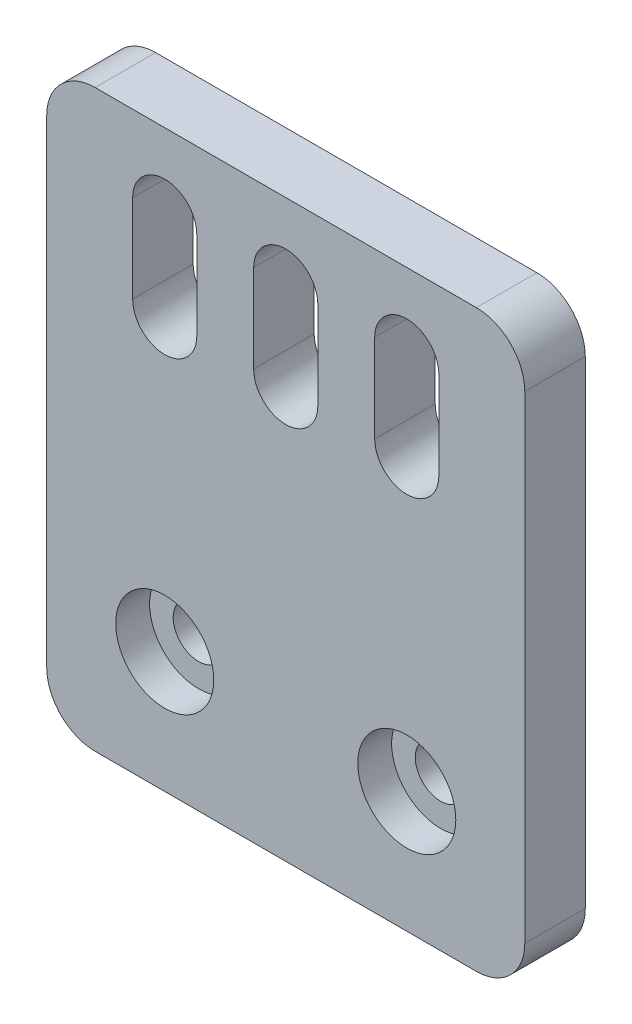
ISO-10303-21;
HEADER;
FILE_DESCRIPTION(('STEP AP214'),'2;1');
FILE_NAME('part.step','',(''),(''),'','','');
FILE_SCHEMA(('AUTOMOTIVE_DESIGN { 1 0 10303 214 1 1 1 1 }'));
ENDSEC;
DATA;
#1=APPLICATION_CONTEXT('core data for automotive mechanical design processes');
#2=APPLICATION_PROTOCOL_DEFINITION('international standard','automotive_design',2000,#1);
#3=PRODUCT_CONTEXT('',#1,'mechanical');
#4=PRODUCT('Part','Part','',(#3));
#5=PRODUCT_RELATED_PRODUCT_CATEGORY('part','',(#4));
#6=PRODUCT_DEFINITION_FORMATION('','',#4);
#7=PRODUCT_DEFINITION_CONTEXT('part definition',#1,'design');
#8=PRODUCT_DEFINITION('design','',#6,#7);
#9=PRODUCT_DEFINITION_SHAPE('','',#8);
#10=(LENGTH_UNIT() NAMED_UNIT(*) SI_UNIT(.MILLI.,.METRE.));
#11=(NAMED_UNIT(*) PLANE_ANGLE_UNIT() SI_UNIT($,.RADIAN.));
#12=(NAMED_UNIT(*) SI_UNIT($,.STERADIAN.) SOLID_ANGLE_UNIT());
#13=UNCERTAINTY_MEASURE_WITH_UNIT(LENGTH_MEASURE(1.E-05),#10,'distance_accuracy_value','');
#14=(GEOMETRIC_REPRESENTATION_CONTEXT(3) GLOBAL_UNCERTAINTY_ASSIGNED_CONTEXT((#13)) GLOBAL_UNIT_ASSIGNED_CONTEXT((#10,
#11,#12)) REPRESENTATION_CONTEXT('',''));
#15=CARTESIAN_POINT('',(0.,0.,0.));
#16=DIRECTION('',(0.,0.,1.));
#17=DIRECTION('',(1.,0.,0.));
#18=AXIS2_PLACEMENT_3D('',#15,#16,#17);
#19=CARTESIAN_POINT('',(9.75000000000001,10.,5.));
#20=DIRECTION('',(0.,0.,-1.));
#21=DIRECTION('',(-1.,0.,0.));
#22=AXIS2_PLACEMENT_3D('',#19,#20,#21);
#23=CYLINDRICAL_SURFACE('',#22,2.09999999999999);
#24=CARTESIAN_POINT('',(9.75000000000001,10.,0.));
#25=DIRECTION('',(0.,0.,1.));
#26=DIRECTION('',(1.,0.,0.));
#27=AXIS2_PLACEMENT_3D('',#24,#25,#26);
#28=CIRCLE('',#27,2.09999999999999);
#29=CARTESIAN_POINT('',(11.85,10.,0.));
#30=VERTEX_POINT('',#29);
#31=EDGE_CURVE('E281',#30,#30,#28,.T.);
#32=ORIENTED_EDGE('',*,*,#31,.F.);
#33=EDGE_LOOP('',(#32));
#34=FACE_BOUND('',#33,.T.);
#35=CARTESIAN_POINT('',(9.75000000000001,10.,2.2));
#36=DIRECTION('',(0.,0.,1.));
#37=DIRECTION('',(1.,0.,0.));
#38=AXIS2_PLACEMENT_3D('',#35,#36,#37);
#39=CIRCLE('',#38,2.09999999999999);
#40=CARTESIAN_POINT('',(11.85,10.,2.2));
#41=VERTEX_POINT('',#40);
#42=EDGE_CURVE('E36',#41,#41,#39,.T.);
#43=ORIENTED_EDGE('',*,*,#42,.T.);
#44=EDGE_LOOP('',(#43));
#45=FACE_BOUND('',#44,.T.);
#46=ADVANCED_FACE('F32',(#34,#45),#23,.F.);
#47=CARTESIAN_POINT('',(29.75,10.,5.));
#48=DIRECTION('',(0.,0.,-1.));
#49=DIRECTION('',(-1.,0.,0.));
#50=AXIS2_PLACEMENT_3D('',#47,#48,#49);
#51=CYLINDRICAL_SURFACE('',#50,2.09999999999999);
#52=CARTESIAN_POINT('',(29.75,10.,0.));
#53=DIRECTION('',(0.,0.,1.));
#54=DIRECTION('',(1.,0.,0.));
#55=AXIS2_PLACEMENT_3D('',#52,#53,#54);
#56=CIRCLE('',#55,2.09999999999999);
#57=CARTESIAN_POINT('',(31.85,10.,0.));
#58=VERTEX_POINT('',#57);
#59=EDGE_CURVE('E278',#58,#58,#56,.T.);
#60=ORIENTED_EDGE('',*,*,#59,.F.);
#61=EDGE_LOOP('',(#60));
#62=FACE_BOUND('',#61,.T.);
#63=CARTESIAN_POINT('',(29.75,10.,2.2));
#64=DIRECTION('',(0.,0.,1.));
#65=DIRECTION('',(1.,0.,0.));
#66=AXIS2_PLACEMENT_3D('',#63,#64,#65);
#67=CIRCLE('',#66,2.09999999999999);
#68=CARTESIAN_POINT('',(31.85,10.,2.2));
#69=VERTEX_POINT('',#68);
#70=EDGE_CURVE('E206',#69,#69,#67,.T.);
#71=ORIENTED_EDGE('',*,*,#70,.T.);
#72=EDGE_LOOP('',(#71));
#73=FACE_BOUND('',#72,.T.);
#74=ADVANCED_FACE('F368',(#62,#73),#51,.F.);
#75=CARTESIAN_POINT('',(0.,0.,5.));
#76=DIRECTION('',(0.,0.,1.));
#77=DIRECTION('',(1.,0.,0.));
#78=AXIS2_PLACEMENT_3D('',#75,#76,#77);
#79=PLANE('',#78);
#80=CARTESIAN_POINT('',(9.75000000000001,10.,5.));
#81=DIRECTION('',(0.,0.,1.));
#82=DIRECTION('',(1.,0.,0.));
#83=AXIS2_PLACEMENT_3D('',#80,#81,#82);
#84=CIRCLE('',#83,4.04999999999999);
#85=CARTESIAN_POINT('',(13.8,10.,5.));
#86=VERTEX_POINT('',#85);
#87=EDGE_CURVE('E346',#86,#86,#84,.T.);
#88=ORIENTED_EDGE('',*,*,#87,.F.);
#89=EDGE_LOOP('',(#88));
#90=FACE_BOUND('',#89,.T.);
#91=CARTESIAN_POINT('',(29.75,10.,5.));
#92=DIRECTION('',(0.,0.,1.));
#93=DIRECTION('',(1.,0.,0.));
#94=AXIS2_PLACEMENT_3D('',#91,#92,#93);
#95=CIRCLE('',#94,4.04999999999999);
#96=CARTESIAN_POINT('',(33.8,10.,5.));
#97=VERTEX_POINT('',#96);
#98=EDGE_CURVE('E340',#97,#97,#95,.T.);
#99=ORIENTED_EDGE('',*,*,#98,.F.);
#100=EDGE_LOOP('',(#99));
#101=FACE_BOUND('',#100,.T.);
#102=DIRECTION('',(0.,-1.,0.));
#103=VECTOR('',#102,1.);
#104=CARTESIAN_POINT('',(0.,47.5,5.));
#105=LINE('',#104,#103);
#106=CARTESIAN_POINT('',(0.,43.5,5.));
#107=VERTEX_POINT('',#106);
#108=CARTESIAN_POINT('',(0.,4.,5.));
#109=VERTEX_POINT('',#108);
#110=EDGE_CURVE('E285',#107,#109,#105,.T.);
#111=ORIENTED_EDGE('',*,*,#110,.T.);
#112=CARTESIAN_POINT('',(4.,4.,5.));
#113=DIRECTION('',(0.,0.,1.));
#114=DIRECTION('',(1.,0.,0.));
#115=AXIS2_PLACEMENT_3D('',#112,#113,#114);
#116=CIRCLE('',#115,4.);
#117=CARTESIAN_POINT('',(4.,0.,5.));
#118=VERTEX_POINT('',#117);
#119=EDGE_CURVE('E328',#109,#118,#116,.T.);
#120=ORIENTED_EDGE('',*,*,#119,.T.);
#121=DIRECTION('',(1.,0.,0.));
#122=VECTOR('',#121,1.);
#123=CARTESIAN_POINT('',(0.,0.,5.));
#124=LINE('',#123,#122);
#125=CARTESIAN_POINT('',(35.5,0.,5.));
#126=VERTEX_POINT('',#125);
#127=EDGE_CURVE('E288',#118,#126,#124,.T.);
#128=ORIENTED_EDGE('',*,*,#127,.T.);
#129=CARTESIAN_POINT('',(35.5,4.,5.));
#130=DIRECTION('',(0.,0.,1.));
#131=DIRECTION('',(1.,0.,0.));
#132=AXIS2_PLACEMENT_3D('',#129,#130,#131);
#133=CIRCLE('',#132,4.);
#134=CARTESIAN_POINT('',(39.5,4.,5.));
#135=VERTEX_POINT('',#134);
#136=EDGE_CURVE('E326',#126,#135,#133,.T.);
#137=ORIENTED_EDGE('',*,*,#136,.T.);
#138=DIRECTION('',(0.,1.,0.));
#139=VECTOR('',#138,1.);
#140=CARTESIAN_POINT('',(39.5,47.5,5.));
#141=LINE('',#140,#139);
#142=CARTESIAN_POINT('',(39.5,43.5,5.));
#143=VERTEX_POINT('',#142);
#144=EDGE_CURVE('E292',#135,#143,#141,.T.);
#145=ORIENTED_EDGE('',*,*,#144,.T.);
#146=CARTESIAN_POINT('',(35.5,43.5,5.));
#147=DIRECTION('',(0.,0.,1.));
#148=DIRECTION('',(1.,0.,0.));
#149=AXIS2_PLACEMENT_3D('',#146,#147,#148);
#150=CIRCLE('',#149,4.);
#151=CARTESIAN_POINT('',(35.5,47.5,5.));
#152=VERTEX_POINT('',#151);
#153=EDGE_CURVE('E55',#143,#152,#150,.T.);
#154=ORIENTED_EDGE('',*,*,#153,.T.);
#155=DIRECTION('',(-1.,0.,0.));
#156=VECTOR('',#155,1.);
#157=CARTESIAN_POINT('',(0.,47.5,5.));
#158=LINE('',#157,#156);
#159=CARTESIAN_POINT('',(4.,47.5,5.));
#160=VERTEX_POINT('',#159);
#161=EDGE_CURVE('E294',#152,#160,#158,.T.);
#162=ORIENTED_EDGE('',*,*,#161,.T.);
#163=CARTESIAN_POINT('',(4.,43.5,5.));
#164=DIRECTION('',(0.,0.,1.));
#165=DIRECTION('',(1.,0.,0.));
#166=AXIS2_PLACEMENT_3D('',#163,#164,#165);
#167=CIRCLE('',#166,4.);
#168=EDGE_CURVE('E323',#160,#107,#167,.T.);
#169=ORIENTED_EDGE('',*,*,#168,.T.);
#170=EDGE_LOOP('',(#111,#120,#128,#137,#145,#154,#162,#169));
#171=FACE_BOUND('',#170,.T.);
#172=DIRECTION('',(0.,-1.,0.));
#173=VECTOR('',#172,1.);
#174=CARTESIAN_POINT('',(7.10000000000005,41.1712979720202,5.));
#175=LINE('',#174,#173);
#176=CARTESIAN_POINT('',(7.10000000000005,41.1712979720202,5.));
#177=VERTEX_POINT('',#176);
#178=CARTESIAN_POINT('',(7.10000000000005,33.9112979720203,5.));
#179=VERTEX_POINT('',#178);
#180=EDGE_CURVE('E250',#177,#179,#175,.T.);
#181=ORIENTED_EDGE('',*,*,#180,.F.);
#182=CARTESIAN_POINT('',(9.75000000000004,41.1712979720202,5.));
#183=DIRECTION('',(0.,0.,1.));
#184=DIRECTION('',(1.,0.,0.));
#185=AXIS2_PLACEMENT_3D('',#182,#183,#184);
#186=CIRCLE('',#185,2.64999999999999);
#187=CARTESIAN_POINT('',(12.4,41.1712979720202,5.));
#188=VERTEX_POINT('',#187);
#189=EDGE_CURVE('E248',#188,#177,#186,.T.);
#190=ORIENTED_EDGE('',*,*,#189,.F.);
#191=DIRECTION('',(0.,1.,0.));
#192=VECTOR('',#191,1.);
#193=CARTESIAN_POINT('',(12.4,41.1712979720202,5.));
#194=LINE('',#193,#192);
#195=CARTESIAN_POINT('',(12.4,33.9112979720203,5.));
#196=VERTEX_POINT('',#195);
#197=EDGE_CURVE('E256',#196,#188,#194,.T.);
#198=ORIENTED_EDGE('',*,*,#197,.F.);
#199=CARTESIAN_POINT('',(9.75000000000004,33.9112979720203,5.));
#200=DIRECTION('',(0.,0.,1.));
#201=DIRECTION('',(1.,0.,0.));
#202=AXIS2_PLACEMENT_3D('',#199,#200,#201);
#203=CIRCLE('',#202,2.64999999999999);
#204=EDGE_CURVE('E253',#179,#196,#203,.T.);
#205=ORIENTED_EDGE('',*,*,#204,.F.);
#206=EDGE_LOOP('',(#181,#190,#198,#205));
#207=FACE_BOUND('',#206,.T.);
#208=DIRECTION('',(0.,-1.,0.));
#209=VECTOR('',#208,1.);
#210=CARTESIAN_POINT('',(17.1,41.1712979720203,5.));
#211=LINE('',#210,#209);
#212=CARTESIAN_POINT('',(17.1,41.1712979720203,5.));
#213=VERTEX_POINT('',#212);
#214=CARTESIAN_POINT('',(17.1,33.9112979720203,5.));
#215=VERTEX_POINT('',#214);
#216=EDGE_CURVE('E219',#213,#215,#211,.T.);
#217=ORIENTED_EDGE('',*,*,#216,.F.);
#218=CARTESIAN_POINT('',(19.75,41.1712979720202,5.));
#219=DIRECTION('',(0.,0.,1.));
#220=DIRECTION('',(1.,0.,0.));
#221=AXIS2_PLACEMENT_3D('',#218,#219,#220);
#222=CIRCLE('',#221,2.64999999999999);
#223=CARTESIAN_POINT('',(22.4,41.1712979720203,5.));
#224=VERTEX_POINT('',#223);
#225=EDGE_CURVE('E217',#224,#213,#222,.T.);
#226=ORIENTED_EDGE('',*,*,#225,.F.);
#227=DIRECTION('',(0.,1.,0.));
#228=VECTOR('',#227,1.);
#229=CARTESIAN_POINT('',(22.4,41.1712979720203,5.));
#230=LINE('',#229,#228);
#231=CARTESIAN_POINT('',(22.4,33.9112979720203,5.));
#232=VERTEX_POINT('',#231);
#233=EDGE_CURVE('E225',#232,#224,#230,.T.);
#234=ORIENTED_EDGE('',*,*,#233,.F.);
#235=CARTESIAN_POINT('',(19.75,33.9112979720203,5.));
#236=DIRECTION('',(0.,0.,1.));
#237=DIRECTION('',(1.,0.,0.));
#238=AXIS2_PLACEMENT_3D('',#235,#236,#237);
#239=CIRCLE('',#238,2.64999999999999);
#240=EDGE_CURVE('E222',#215,#232,#239,.T.);
#241=ORIENTED_EDGE('',*,*,#240,.F.);
#242=EDGE_LOOP('',(#217,#226,#234,#241));
#243=FACE_BOUND('',#242,.T.);
#244=DIRECTION('',(0.,-1.,0.));
#245=VECTOR('',#244,1.);
#246=CARTESIAN_POINT('',(27.1000000000001,41.1712979720202,5.));
#247=LINE('',#246,#245);
#248=CARTESIAN_POINT('',(27.1000000000001,41.1712979720202,5.));
#249=VERTEX_POINT('',#248);
#250=CARTESIAN_POINT('',(27.1000000000001,33.9112979720203,5.));
#251=VERTEX_POINT('',#250);
#252=EDGE_CURVE('E183',#249,#251,#247,.T.);
#253=ORIENTED_EDGE('',*,*,#252,.F.);
#254=CARTESIAN_POINT('',(29.7500000000001,41.1712979720202,5.));
#255=DIRECTION('',(0.,0.,1.));
#256=DIRECTION('',(1.,0.,0.));
#257=AXIS2_PLACEMENT_3D('',#254,#255,#256);
#258=CIRCLE('',#257,2.64999999999999);
#259=CARTESIAN_POINT('',(32.4,41.1712979720202,5.));
#260=VERTEX_POINT('',#259);
#261=EDGE_CURVE('E173',#260,#249,#258,.T.);
#262=ORIENTED_EDGE('',*,*,#261,.F.);
#263=DIRECTION('',(0.,1.,0.));
#264=VECTOR('',#263,1.);
#265=CARTESIAN_POINT('',(32.4,41.1712979720202,5.));
#266=LINE('',#265,#264);
#267=CARTESIAN_POINT('',(32.4,33.9112979720203,5.));
#268=VERTEX_POINT('',#267);
#269=EDGE_CURVE('E199',#268,#260,#266,.T.);
#270=ORIENTED_EDGE('',*,*,#269,.F.);
#271=CARTESIAN_POINT('',(29.7500000000001,33.9112979720203,5.));
#272=DIRECTION('',(0.,0.,1.));
#273=DIRECTION('',(1.,0.,0.));
#274=AXIS2_PLACEMENT_3D('',#271,#272,#273);
#275=CIRCLE('',#274,2.64999999999999);
#276=EDGE_CURVE('E197',#251,#268,#275,.T.);
#277=ORIENTED_EDGE('',*,*,#276,.F.);
#278=EDGE_LOOP('',(#253,#262,#270,#277));
#279=FACE_BOUND('',#278,.T.);
#280=ADVANCED_FACE('F195',(#90,#101,#171,#207,#243,#279),#79,.T.);
#281=CARTESIAN_POINT('',(0.,0.,0.));
#282=DIRECTION('',(0.,0.,1.));
#283=DIRECTION('',(1.,0.,0.));
#284=AXIS2_PLACEMENT_3D('',#281,#282,#283);
#285=PLANE('',#284);
#286=CARTESIAN_POINT('',(19.75,41.1712979720202,0.));
#287=DIRECTION('',(0.,0.,1.));
#288=DIRECTION('',(1.,0.,0.));
#289=AXIS2_PLACEMENT_3D('',#286,#287,#288);
#290=CIRCLE('',#289,2.64999999999999);
#291=CARTESIAN_POINT('',(22.4,41.1712979720203,0.));
#292=VERTEX_POINT('',#291);
#293=CARTESIAN_POINT('',(17.1,41.1712979720203,0.));
#294=VERTEX_POINT('',#293);
#295=EDGE_CURVE('E191',#292,#294,#290,.T.);
#296=ORIENTED_EDGE('',*,*,#295,.T.);
#297=DIRECTION('',(0.,-1.,0.));
#298=VECTOR('',#297,1.);
#299=CARTESIAN_POINT('',(17.1,41.1712979720203,0.));
#300=LINE('',#299,#298);
#301=CARTESIAN_POINT('',(17.1,33.9112979720203,0.));
#302=VERTEX_POINT('',#301);
#303=EDGE_CURVE('E230',#294,#302,#300,.T.);
#304=ORIENTED_EDGE('',*,*,#303,.T.);
#305=CARTESIAN_POINT('',(19.75,33.9112979720203,0.));
#306=DIRECTION('',(0.,0.,1.));
#307=DIRECTION('',(1.,0.,0.));
#308=AXIS2_PLACEMENT_3D('',#305,#306,#307);
#309=CIRCLE('',#308,2.64999999999999);
#310=CARTESIAN_POINT('',(22.4,33.9112979720203,0.));
#311=VERTEX_POINT('',#310);
#312=EDGE_CURVE('E233',#302,#311,#309,.T.);
#313=ORIENTED_EDGE('',*,*,#312,.T.);
#314=DIRECTION('',(0.,1.,0.));
#315=VECTOR('',#314,1.);
#316=CARTESIAN_POINT('',(22.4,41.1712979720203,0.));
#317=LINE('',#316,#315);
#318=EDGE_CURVE('E220',#311,#292,#317,.T.);
#319=ORIENTED_EDGE('',*,*,#318,.T.);
#320=EDGE_LOOP('',(#296,#304,#313,#319));
#321=FACE_BOUND('',#320,.T.);
#322=ORIENTED_EDGE('',*,*,#59,.T.);
#323=EDGE_LOOP('',(#322));
#324=FACE_BOUND('',#323,.T.);
#325=ORIENTED_EDGE('',*,*,#31,.T.);
#326=EDGE_LOOP('',(#325));
#327=FACE_BOUND('',#326,.T.);
#328=DIRECTION('',(1.,0.,0.));
#329=VECTOR('',#328,1.);
#330=CARTESIAN_POINT('',(0.,0.,0.));
#331=LINE('',#330,#329);
#332=CARTESIAN_POINT('',(4.,0.,0.));
#333=VERTEX_POINT('',#332);
#334=CARTESIAN_POINT('',(35.5,0.,0.));
#335=VERTEX_POINT('',#334);
#336=EDGE_CURVE('E299',#333,#335,#331,.T.);
#337=ORIENTED_EDGE('',*,*,#336,.F.);
#338=CARTESIAN_POINT('',(4.,4.,0.));
#339=DIRECTION('',(0.,0.,1.));
#340=DIRECTION('',(1.,0.,0.));
#341=AXIS2_PLACEMENT_3D('',#338,#339,#340);
#342=CIRCLE('',#341,4.);
#343=CARTESIAN_POINT('',(0.,4.,0.));
#344=VERTEX_POINT('',#343);
#345=EDGE_CURVE('E316',#333,#344,#342,.F.);
#346=ORIENTED_EDGE('',*,*,#345,.T.);
#347=DIRECTION('',(0.,-1.,0.));
#348=VECTOR('',#347,1.);
#349=CARTESIAN_POINT('',(0.,47.5,0.));
#350=LINE('',#349,#348);
#351=CARTESIAN_POINT('',(0.,43.5,0.));
#352=VERTEX_POINT('',#351);
#353=EDGE_CURVE('E284',#352,#344,#350,.T.);
#354=ORIENTED_EDGE('',*,*,#353,.F.);
#355=CARTESIAN_POINT('',(4.,43.5,0.));
#356=DIRECTION('',(0.,0.,1.));
#357=DIRECTION('',(1.,0.,0.));
#358=AXIS2_PLACEMENT_3D('',#355,#356,#357);
#359=CIRCLE('',#358,4.);
#360=CARTESIAN_POINT('',(4.,47.5,0.));
#361=VERTEX_POINT('',#360);
#362=EDGE_CURVE('E310',#352,#361,#359,.F.);
#363=ORIENTED_EDGE('',*,*,#362,.T.);
#364=DIRECTION('',(-1.,0.,0.));
#365=VECTOR('',#364,1.);
#366=CARTESIAN_POINT('',(0.,47.5,0.));
#367=LINE('',#366,#365);
#368=CARTESIAN_POINT('',(35.5,47.5,0.));
#369=VERTEX_POINT('',#368);
#370=EDGE_CURVE('E289',#369,#361,#367,.T.);
#371=ORIENTED_EDGE('',*,*,#370,.F.);
#372=CARTESIAN_POINT('',(35.5,43.5,0.));
#373=DIRECTION('',(0.,0.,1.));
#374=DIRECTION('',(1.,0.,0.));
#375=AXIS2_PLACEMENT_3D('',#372,#373,#374);
#376=CIRCLE('',#375,4.);
#377=CARTESIAN_POINT('',(39.5,43.5,0.));
#378=VERTEX_POINT('',#377);
#379=EDGE_CURVE('E312',#369,#378,#376,.F.);
#380=ORIENTED_EDGE('',*,*,#379,.T.);
#381=DIRECTION('',(0.,1.,0.));
#382=VECTOR('',#381,1.);
#383=CARTESIAN_POINT('',(39.5,47.5,0.));
#384=LINE('',#383,#382);
#385=CARTESIAN_POINT('',(39.5,4.,0.));
#386=VERTEX_POINT('',#385);
#387=EDGE_CURVE('E302',#386,#378,#384,.T.);
#388=ORIENTED_EDGE('',*,*,#387,.F.);
#389=CARTESIAN_POINT('',(35.5,4.,0.));
#390=DIRECTION('',(0.,0.,1.));
#391=DIRECTION('',(1.,0.,0.));
#392=AXIS2_PLACEMENT_3D('',#389,#390,#391);
#393=CIRCLE('',#392,4.);
#394=EDGE_CURVE('E314',#386,#335,#393,.F.);
#395=ORIENTED_EDGE('',*,*,#394,.T.);
#396=EDGE_LOOP('',(#337,#346,#354,#363,#371,#380,#388,#395));
#397=FACE_BOUND('',#396,.T.);
#398=CARTESIAN_POINT('',(9.75000000000004,41.1712979720202,0.));
#399=DIRECTION('',(0.,0.,1.));
#400=DIRECTION('',(1.,0.,0.));
#401=AXIS2_PLACEMENT_3D('',#398,#399,#400);
#402=CIRCLE('',#401,2.64999999999999);
#403=CARTESIAN_POINT('',(12.4,41.1712979720202,0.));
#404=VERTEX_POINT('',#403);
#405=CARTESIAN_POINT('',(7.10000000000005,41.1712979720202,0.));
#406=VERTEX_POINT('',#405);
#407=EDGE_CURVE('E247',#404,#406,#402,.T.);
#408=ORIENTED_EDGE('',*,*,#407,.T.);
#409=DIRECTION('',(0.,-1.,0.));
#410=VECTOR('',#409,1.);
#411=CARTESIAN_POINT('',(7.10000000000005,41.1712979720202,0.));
#412=LINE('',#411,#410);
#413=CARTESIAN_POINT('',(7.10000000000005,33.9112979720203,0.));
#414=VERTEX_POINT('',#413);
#415=EDGE_CURVE('E261',#406,#414,#412,.T.);
#416=ORIENTED_EDGE('',*,*,#415,.T.);
#417=CARTESIAN_POINT('',(9.75000000000004,33.9112979720203,0.));
#418=DIRECTION('',(0.,0.,1.));
#419=DIRECTION('',(1.,0.,0.));
#420=AXIS2_PLACEMENT_3D('',#417,#418,#419);
#421=CIRCLE('',#420,2.64999999999999);
#422=CARTESIAN_POINT('',(12.4,33.9112979720203,0.));
#423=VERTEX_POINT('',#422);
#424=EDGE_CURVE('E264',#414,#423,#421,.T.);
#425=ORIENTED_EDGE('',*,*,#424,.T.);
#426=DIRECTION('',(0.,1.,0.));
#427=VECTOR('',#426,1.);
#428=CARTESIAN_POINT('',(12.4,41.1712979720202,0.));
#429=LINE('',#428,#427);
#430=EDGE_CURVE('E251',#423,#404,#429,.T.);
#431=ORIENTED_EDGE('',*,*,#430,.T.);
#432=EDGE_LOOP('',(#408,#416,#425,#431));
#433=FACE_BOUND('',#432,.T.);
#434=CARTESIAN_POINT('',(29.7500000000001,41.1712979720202,0.));
#435=DIRECTION('',(0.,0.,1.));
#436=DIRECTION('',(1.,0.,0.));
#437=AXIS2_PLACEMENT_3D('',#434,#435,#436);
#438=CIRCLE('',#437,2.64999999999999);
#439=CARTESIAN_POINT('',(32.4,41.1712979720202,0.));
#440=VERTEX_POINT('',#439);
#441=CARTESIAN_POINT('',(27.1000000000001,41.1712979720202,0.));
#442=VERTEX_POINT('',#441);
#443=EDGE_CURVE('E204',#440,#442,#438,.T.);
#444=ORIENTED_EDGE('',*,*,#443,.T.);
#445=DIRECTION('',(0.,-1.,0.));
#446=VECTOR('',#445,1.);
#447=CARTESIAN_POINT('',(27.1000000000001,41.1712979720202,0.));
#448=LINE('',#447,#446);
#449=CARTESIAN_POINT('',(27.1000000000001,33.9112979720203,0.));
#450=VERTEX_POINT('',#449);
#451=EDGE_CURVE('E190',#442,#450,#448,.T.);
#452=ORIENTED_EDGE('',*,*,#451,.T.);
#453=CARTESIAN_POINT('',(29.7500000000001,33.9112979720203,0.));
#454=DIRECTION('',(0.,0.,1.));
#455=DIRECTION('',(1.,0.,0.));
#456=AXIS2_PLACEMENT_3D('',#453,#454,#455);
#457=CIRCLE('',#456,2.64999999999999);
#458=CARTESIAN_POINT('',(32.4,33.9112979720203,0.));
#459=VERTEX_POINT('',#458);
#460=EDGE_CURVE('E208',#450,#459,#457,.T.);
#461=ORIENTED_EDGE('',*,*,#460,.T.);
#462=DIRECTION('',(0.,1.,0.));
#463=VECTOR('',#462,1.);
#464=CARTESIAN_POINT('',(32.4,41.1712979720202,0.));
#465=LINE('',#464,#463);
#466=EDGE_CURVE('E184',#459,#440,#465,.T.);
#467=ORIENTED_EDGE('',*,*,#466,.T.);
#468=EDGE_LOOP('',(#444,#452,#461,#467));
#469=FACE_BOUND('',#468,.T.);
#470=ADVANCED_FACE('F381',(#321,#324,#327,#397,#433,#469),#285,.F.);
#471=CARTESIAN_POINT('',(0.,47.5,5.));
#472=DIRECTION('',(1.,0.,0.));
#473=DIRECTION('',(0.,0.,-1.));
#474=AXIS2_PLACEMENT_3D('',#471,#472,#473);
#475=PLANE('',#474);
#476=ORIENTED_EDGE('',*,*,#353,.T.);
#477=DIRECTION('',(0.,0.,-1.));
#478=VECTOR('',#477,1.);
#479=CARTESIAN_POINT('',(0.,4.,5.));
#480=LINE('',#479,#478);
#481=EDGE_CURVE('E321',#344,#109,#480,.F.);
#482=ORIENTED_EDGE('',*,*,#481,.T.);
#483=ORIENTED_EDGE('',*,*,#110,.F.);
#484=DIRECTION('',(0.,0.,-1.));
#485=VECTOR('',#484,1.);
#486=CARTESIAN_POINT('',(0.,43.5,5.));
#487=LINE('',#486,#485);
#488=EDGE_CURVE('E318',#107,#352,#487,.T.);
#489=ORIENTED_EDGE('',*,*,#488,.T.);
#490=EDGE_LOOP('',(#476,#482,#483,#489));
#491=FACE_BOUND('',#490,.T.);
#492=ADVANCED_FACE('F385',(#491),#475,.F.);
#493=CARTESIAN_POINT('',(0.,0.,5.));
#494=DIRECTION('',(0.,1.,0.));
#495=DIRECTION('',(0.,0.,1.));
#496=AXIS2_PLACEMENT_3D('',#493,#494,#495);
#497=PLANE('',#496);
#498=ORIENTED_EDGE('',*,*,#127,.F.);
#499=DIRECTION('',(0.,0.,-1.));
#500=VECTOR('',#499,1.);
#501=CARTESIAN_POINT('',(4.,0.,5.));
#502=LINE('',#501,#500);
#503=EDGE_CURVE('E307',#118,#333,#502,.T.);
#504=ORIENTED_EDGE('',*,*,#503,.T.);
#505=ORIENTED_EDGE('',*,*,#336,.T.);
#506=DIRECTION('',(0.,0.,-1.));
#507=VECTOR('',#506,1.);
#508=CARTESIAN_POINT('',(35.5,0.,5.));
#509=LINE('',#508,#507);
#510=EDGE_CURVE('E296',#335,#126,#509,.F.);
#511=ORIENTED_EDGE('',*,*,#510,.T.);
#512=EDGE_LOOP('',(#498,#504,#505,#511));
#513=FACE_BOUND('',#512,.T.);
#514=ADVANCED_FACE('F394',(#513),#497,.F.);
#515=CARTESIAN_POINT('',(39.5,47.5,5.));
#516=DIRECTION('',(-1.,0.,0.));
#517=DIRECTION('',(0.,0.,1.));
#518=AXIS2_PLACEMENT_3D('',#515,#516,#517);
#519=PLANE('',#518);
#520=ORIENTED_EDGE('',*,*,#144,.F.);
#521=DIRECTION('',(0.,0.,-1.));
#522=VECTOR('',#521,1.);
#523=CARTESIAN_POINT('',(39.5,4.,5.));
#524=LINE('',#523,#522);
#525=EDGE_CURVE('E332',#135,#386,#524,.T.);
#526=ORIENTED_EDGE('',*,*,#525,.T.);
#527=ORIENTED_EDGE('',*,*,#387,.T.);
#528=DIRECTION('',(0.,0.,-1.));
#529=VECTOR('',#528,1.);
#530=CARTESIAN_POINT('',(39.5,43.5,5.));
#531=LINE('',#530,#529);
#532=EDGE_CURVE('E330',#378,#143,#531,.F.);
#533=ORIENTED_EDGE('',*,*,#532,.T.);
#534=EDGE_LOOP('',(#520,#526,#527,#533));
#535=FACE_BOUND('',#534,.T.);
#536=ADVANCED_FACE('F391',(#535),#519,.F.);
#537=CARTESIAN_POINT('',(0.,47.5,5.));
#538=DIRECTION('',(0.,-1.,0.));
#539=DIRECTION('',(0.,0.,-1.));
#540=AXIS2_PLACEMENT_3D('',#537,#538,#539);
#541=PLANE('',#540);
#542=ORIENTED_EDGE('',*,*,#161,.F.);
#543=DIRECTION('',(0.,0.,-1.));
#544=VECTOR('',#543,1.);
#545=CARTESIAN_POINT('',(35.5,47.5,5.));
#546=LINE('',#545,#544);
#547=EDGE_CURVE('E11',#152,#369,#546,.T.);
#548=ORIENTED_EDGE('',*,*,#547,.T.);
#549=ORIENTED_EDGE('',*,*,#370,.T.);
#550=DIRECTION('',(0.,0.,-1.));
#551=VECTOR('',#550,1.);
#552=CARTESIAN_POINT('',(4.,47.5,5.));
#553=LINE('',#552,#551);
#554=EDGE_CURVE('E41',#361,#160,#553,.F.);
#555=ORIENTED_EDGE('',*,*,#554,.T.);
#556=EDGE_LOOP('',(#542,#548,#549,#555));
#557=FACE_BOUND('',#556,.T.);
#558=ADVANCED_FACE('F387',(#557),#541,.F.);
#559=CARTESIAN_POINT('',(9.75000000000004,41.1712979720202,5.));
#560=DIRECTION('',(0.,0.,-1.));
#561=DIRECTION('',(-1.,0.,0.));
#562=AXIS2_PLACEMENT_3D('',#559,#560,#561);
#563=CYLINDRICAL_SURFACE('',#562,2.64999999999999);
#564=ORIENTED_EDGE('',*,*,#407,.F.);
#565=DIRECTION('',(0.,0.,-1.));
#566=VECTOR('',#565,1.);
#567=CARTESIAN_POINT('',(12.4,41.1712979720202,5.));
#568=LINE('',#567,#566);
#569=EDGE_CURVE('E258',#188,#404,#568,.T.);
#570=ORIENTED_EDGE('',*,*,#569,.F.);
#571=ORIENTED_EDGE('',*,*,#189,.T.);
#572=DIRECTION('',(0.,0.,-1.));
#573=VECTOR('',#572,1.);
#574=CARTESIAN_POINT('',(7.10000000000005,41.1712979720202,5.));
#575=LINE('',#574,#573);
#576=EDGE_CURVE('E275',#177,#406,#575,.T.);
#577=ORIENTED_EDGE('',*,*,#576,.T.);
#578=EDGE_LOOP('',(#564,#570,#571,#577));
#579=FACE_BOUND('',#578,.T.);
#580=ADVANCED_FACE('F390',(#579),#563,.F.);
#581=CARTESIAN_POINT('',(7.10000000000005,41.1712979720202,5.));
#582=DIRECTION('',(1.,0.,0.));
#583=DIRECTION('',(0.,0.,-1.));
#584=AXIS2_PLACEMENT_3D('',#581,#582,#583);
#585=PLANE('',#584);
#586=ORIENTED_EDGE('',*,*,#415,.F.);
#587=ORIENTED_EDGE('',*,*,#576,.F.);
#588=ORIENTED_EDGE('',*,*,#180,.T.);
#589=DIRECTION('',(0.,0.,-1.));
#590=VECTOR('',#589,1.);
#591=CARTESIAN_POINT('',(7.10000000000005,33.9112979720203,5.));
#592=LINE('',#591,#590);
#593=EDGE_CURVE('E273',#179,#414,#592,.T.);
#594=ORIENTED_EDGE('',*,*,#593,.T.);
#595=EDGE_LOOP('',(#586,#587,#588,#594));
#596=FACE_BOUND('',#595,.T.);
#597=ADVANCED_FACE('F481',(#596),#585,.T.);
#598=CARTESIAN_POINT('',(9.75000000000004,33.9112979720203,5.));
#599=DIRECTION('',(0.,0.,-1.));
#600=DIRECTION('',(-1.,0.,0.));
#601=AXIS2_PLACEMENT_3D('',#598,#599,#600);
#602=CYLINDRICAL_SURFACE('',#601,2.64999999999999);
#603=ORIENTED_EDGE('',*,*,#424,.F.);
#604=ORIENTED_EDGE('',*,*,#593,.F.);
#605=ORIENTED_EDGE('',*,*,#204,.T.);
#606=DIRECTION('',(0.,0.,-1.));
#607=VECTOR('',#606,1.);
#608=CARTESIAN_POINT('',(12.4,33.9112979720203,5.));
#609=LINE('',#608,#607);
#610=EDGE_CURVE('E271',#196,#423,#609,.T.);
#611=ORIENTED_EDGE('',*,*,#610,.T.);
#612=EDGE_LOOP('',(#603,#604,#605,#611));
#613=FACE_BOUND('',#612,.T.);
#614=ADVANCED_FACE('F477',(#613),#602,.F.);
#615=CARTESIAN_POINT('',(12.4,41.1712979720202,5.));
#616=DIRECTION('',(-1.,0.,0.));
#617=DIRECTION('',(0.,0.,1.));
#618=AXIS2_PLACEMENT_3D('',#615,#616,#617);
#619=PLANE('',#618);
#620=ORIENTED_EDGE('',*,*,#430,.F.);
#621=ORIENTED_EDGE('',*,*,#610,.F.);
#622=ORIENTED_EDGE('',*,*,#197,.T.);
#623=ORIENTED_EDGE('',*,*,#569,.T.);
#624=EDGE_LOOP('',(#620,#621,#622,#623));
#625=FACE_BOUND('',#624,.T.);
#626=ADVANCED_FACE('F474',(#625),#619,.T.);
#627=CARTESIAN_POINT('',(19.75,41.1712979720202,5.));
#628=DIRECTION('',(0.,0.,-1.));
#629=DIRECTION('',(-1.,0.,0.));
#630=AXIS2_PLACEMENT_3D('',#627,#628,#629);
#631=CYLINDRICAL_SURFACE('',#630,2.64999999999999);
#632=ORIENTED_EDGE('',*,*,#295,.F.);
#633=DIRECTION('',(0.,0.,-1.));
#634=VECTOR('',#633,1.);
#635=CARTESIAN_POINT('',(22.4,41.1712979720203,5.));
#636=LINE('',#635,#634);
#637=EDGE_CURVE('E227',#224,#292,#636,.T.);
#638=ORIENTED_EDGE('',*,*,#637,.F.);
#639=ORIENTED_EDGE('',*,*,#225,.T.);
#640=DIRECTION('',(0.,0.,-1.));
#641=VECTOR('',#640,1.);
#642=CARTESIAN_POINT('',(17.1,41.1712979720203,5.));
#643=LINE('',#642,#641);
#644=EDGE_CURVE('E244',#213,#294,#643,.T.);
#645=ORIENTED_EDGE('',*,*,#644,.T.);
#646=EDGE_LOOP('',(#632,#638,#639,#645));
#647=FACE_BOUND('',#646,.T.);
#648=ADVANCED_FACE('F456',(#647),#631,.F.);
#649=CARTESIAN_POINT('',(17.1,41.1712979720203,5.));
#650=DIRECTION('',(1.,0.,0.));
#651=DIRECTION('',(0.,0.,-1.));
#652=AXIS2_PLACEMENT_3D('',#649,#650,#651);
#653=PLANE('',#652);
#654=ORIENTED_EDGE('',*,*,#303,.F.);
#655=ORIENTED_EDGE('',*,*,#644,.F.);
#656=ORIENTED_EDGE('',*,*,#216,.T.);
#657=DIRECTION('',(0.,0.,-1.));
#658=VECTOR('',#657,1.);
#659=CARTESIAN_POINT('',(17.1,33.9112979720203,5.));
#660=LINE('',#659,#658);
#661=EDGE_CURVE('E242',#215,#302,#660,.T.);
#662=ORIENTED_EDGE('',*,*,#661,.T.);
#663=EDGE_LOOP('',(#654,#655,#656,#662));
#664=FACE_BOUND('',#663,.T.);
#665=ADVANCED_FACE('F449',(#664),#653,.T.);
#666=CARTESIAN_POINT('',(19.75,33.9112979720203,5.));
#667=DIRECTION('',(0.,0.,-1.));
#668=DIRECTION('',(-1.,0.,0.));
#669=AXIS2_PLACEMENT_3D('',#666,#667,#668);
#670=CYLINDRICAL_SURFACE('',#669,2.64999999999999);
#671=ORIENTED_EDGE('',*,*,#312,.F.);
#672=ORIENTED_EDGE('',*,*,#661,.F.);
#673=ORIENTED_EDGE('',*,*,#240,.T.);
#674=DIRECTION('',(0.,0.,-1.));
#675=VECTOR('',#674,1.);
#676=CARTESIAN_POINT('',(22.4,33.9112979720203,5.));
#677=LINE('',#676,#675);
#678=EDGE_CURVE('E240',#232,#311,#677,.T.);
#679=ORIENTED_EDGE('',*,*,#678,.T.);
#680=EDGE_LOOP('',(#671,#672,#673,#679));
#681=FACE_BOUND('',#680,.T.);
#682=ADVANCED_FACE('F452',(#681),#670,.F.);
#683=CARTESIAN_POINT('',(22.4,41.1712979720203,5.));
#684=DIRECTION('',(-1.,0.,0.));
#685=DIRECTION('',(0.,0.,1.));
#686=AXIS2_PLACEMENT_3D('',#683,#684,#685);
#687=PLANE('',#686);
#688=ORIENTED_EDGE('',*,*,#318,.F.);
#689=ORIENTED_EDGE('',*,*,#678,.F.);
#690=ORIENTED_EDGE('',*,*,#233,.T.);
#691=ORIENTED_EDGE('',*,*,#637,.T.);
#692=EDGE_LOOP('',(#688,#689,#690,#691));
#693=FACE_BOUND('',#692,.T.);
#694=ADVANCED_FACE('F459',(#693),#687,.T.);
#695=CARTESIAN_POINT('',(29.7500000000001,41.1712979720202,5.));
#696=DIRECTION('',(0.,0.,-1.));
#697=DIRECTION('',(-1.,0.,0.));
#698=AXIS2_PLACEMENT_3D('',#695,#696,#697);
#699=CYLINDRICAL_SURFACE('',#698,2.64999999999999);
#700=ORIENTED_EDGE('',*,*,#443,.F.);
#701=DIRECTION('',(0.,0.,-1.));
#702=VECTOR('',#701,1.);
#703=CARTESIAN_POINT('',(32.4,41.1712979720202,5.));
#704=LINE('',#703,#702);
#705=EDGE_CURVE('E179',#260,#440,#704,.T.);
#706=ORIENTED_EDGE('',*,*,#705,.F.);
#707=ORIENTED_EDGE('',*,*,#261,.T.);
#708=DIRECTION('',(0.,0.,-1.));
#709=VECTOR('',#708,1.);
#710=CARTESIAN_POINT('',(27.1000000000001,41.1712979720202,5.));
#711=LINE('',#710,#709);
#712=EDGE_CURVE('E176',#249,#442,#711,.T.);
#713=ORIENTED_EDGE('',*,*,#712,.T.);
#714=EDGE_LOOP('',(#700,#706,#707,#713));
#715=FACE_BOUND('',#714,.T.);
#716=ADVANCED_FACE('F175',(#715),#699,.F.);
#717=CARTESIAN_POINT('',(27.1000000000001,41.1712979720202,5.));
#718=DIRECTION('',(1.,0.,0.));
#719=DIRECTION('',(0.,0.,-1.));
#720=AXIS2_PLACEMENT_3D('',#717,#718,#719);
#721=PLANE('',#720);
#722=ORIENTED_EDGE('',*,*,#451,.F.);
#723=ORIENTED_EDGE('',*,*,#712,.F.);
#724=ORIENTED_EDGE('',*,*,#252,.T.);
#725=DIRECTION('',(0.,0.,-1.));
#726=VECTOR('',#725,1.);
#727=CARTESIAN_POINT('',(27.1000000000001,33.9112979720203,5.));
#728=LINE('',#727,#726);
#729=EDGE_CURVE('E192',#251,#450,#728,.T.);
#730=ORIENTED_EDGE('',*,*,#729,.T.);
#731=EDGE_LOOP('',(#722,#723,#724,#730));
#732=FACE_BOUND('',#731,.T.);
#733=ADVANCED_FACE('F187',(#732),#721,.T.);
#734=CARTESIAN_POINT('',(29.7500000000001,33.9112979720203,5.));
#735=DIRECTION('',(0.,0.,-1.));
#736=DIRECTION('',(-1.,0.,0.));
#737=AXIS2_PLACEMENT_3D('',#734,#735,#736);
#738=CYLINDRICAL_SURFACE('',#737,2.64999999999999);
#739=ORIENTED_EDGE('',*,*,#460,.F.);
#740=ORIENTED_EDGE('',*,*,#729,.F.);
#741=ORIENTED_EDGE('',*,*,#276,.T.);
#742=DIRECTION('',(0.,0.,-1.));
#743=VECTOR('',#742,1.);
#744=CARTESIAN_POINT('',(32.4,33.9112979720203,5.));
#745=LINE('',#744,#743);
#746=EDGE_CURVE('E214',#268,#459,#745,.T.);
#747=ORIENTED_EDGE('',*,*,#746,.T.);
#748=EDGE_LOOP('',(#739,#740,#741,#747));
#749=FACE_BOUND('',#748,.T.);
#750=ADVANCED_FACE('F500',(#749),#738,.F.);
#751=CARTESIAN_POINT('',(32.4,41.1712979720202,5.));
#752=DIRECTION('',(-1.,0.,0.));
#753=DIRECTION('',(0.,0.,1.));
#754=AXIS2_PLACEMENT_3D('',#751,#752,#753);
#755=PLANE('',#754);
#756=ORIENTED_EDGE('',*,*,#466,.F.);
#757=ORIENTED_EDGE('',*,*,#746,.F.);
#758=ORIENTED_EDGE('',*,*,#269,.T.);
#759=ORIENTED_EDGE('',*,*,#705,.T.);
#760=EDGE_LOOP('',(#756,#757,#758,#759));
#761=FACE_BOUND('',#760,.T.);
#762=ADVANCED_FACE('F406',(#761),#755,.T.);
#763=CARTESIAN_POINT('',(4.,4.,5.));
#764=DIRECTION('',(0.,0.,-1.));
#765=DIRECTION('',(-1.,0.,0.));
#766=AXIS2_PLACEMENT_3D('',#763,#764,#765);
#767=CYLINDRICAL_SURFACE('',#766,4.);
#768=ORIENTED_EDGE('',*,*,#119,.F.);
#769=ORIENTED_EDGE('',*,*,#481,.F.);
#770=ORIENTED_EDGE('',*,*,#345,.F.);
#771=ORIENTED_EDGE('',*,*,#503,.F.);
#772=EDGE_LOOP('',(#768,#769,#770,#771));
#773=FACE_BOUND('',#772,.T.);
#774=ADVANCED_FACE('F402',(#773),#767,.T.);
#775=CARTESIAN_POINT('',(35.5,4.,5.));
#776=DIRECTION('',(0.,0.,-1.));
#777=DIRECTION('',(-1.,0.,0.));
#778=AXIS2_PLACEMENT_3D('',#775,#776,#777);
#779=CYLINDRICAL_SURFACE('',#778,4.);
#780=ORIENTED_EDGE('',*,*,#136,.F.);
#781=ORIENTED_EDGE('',*,*,#510,.F.);
#782=ORIENTED_EDGE('',*,*,#394,.F.);
#783=ORIENTED_EDGE('',*,*,#525,.F.);
#784=EDGE_LOOP('',(#780,#781,#782,#783));
#785=FACE_BOUND('',#784,.T.);
#786=ADVANCED_FACE('F405',(#785),#779,.T.);
#787=CARTESIAN_POINT('',(35.5,43.5,5.));
#788=DIRECTION('',(0.,0.,-1.));
#789=DIRECTION('',(-1.,0.,0.));
#790=AXIS2_PLACEMENT_3D('',#787,#788,#789);
#791=CYLINDRICAL_SURFACE('',#790,4.);
#792=ORIENTED_EDGE('',*,*,#153,.F.);
#793=ORIENTED_EDGE('',*,*,#532,.F.);
#794=ORIENTED_EDGE('',*,*,#379,.F.);
#795=ORIENTED_EDGE('',*,*,#547,.F.);
#796=EDGE_LOOP('',(#792,#793,#794,#795));
#797=FACE_BOUND('',#796,.T.);
#798=ADVANCED_FACE('F409',(#797),#791,.T.);
#799=CARTESIAN_POINT('',(4.,43.5,5.));
#800=DIRECTION('',(0.,0.,-1.));
#801=DIRECTION('',(-1.,0.,0.));
#802=AXIS2_PLACEMENT_3D('',#799,#800,#801);
#803=CYLINDRICAL_SURFACE('',#802,4.);
#804=ORIENTED_EDGE('',*,*,#168,.F.);
#805=ORIENTED_EDGE('',*,*,#554,.F.);
#806=ORIENTED_EDGE('',*,*,#362,.F.);
#807=ORIENTED_EDGE('',*,*,#488,.F.);
#808=EDGE_LOOP('',(#804,#805,#806,#807));
#809=FACE_BOUND('',#808,.T.);
#810=ADVANCED_FACE('F34',(#809),#803,.T.);
#811=CARTESIAN_POINT('',(29.75,10.,2.2));
#812=DIRECTION('',(0.,0.,1.));
#813=DIRECTION('',(1.,0.,0.));
#814=AXIS2_PLACEMENT_3D('',#811,#812,#813);
#815=CYLINDRICAL_SURFACE('',#814,4.04999999999999);
#816=CARTESIAN_POINT('',(29.75,10.,2.2));
#817=DIRECTION('',(0.,0.,1.));
#818=DIRECTION('',(1.,0.,0.));
#819=AXIS2_PLACEMENT_3D('',#816,#817,#818);
#820=CIRCLE('',#819,4.04999999999999);
#821=CARTESIAN_POINT('',(33.8,10.,2.2));
#822=VERTEX_POINT('',#821);
#823=EDGE_CURVE('E336',#822,#822,#820,.T.);
#824=ORIENTED_EDGE('',*,*,#823,.F.);
#825=EDGE_LOOP('',(#824));
#826=FACE_BOUND('',#825,.T.);
#827=ORIENTED_EDGE('',*,*,#98,.T.);
#828=EDGE_LOOP('',(#827));
#829=FACE_BOUND('',#828,.T.);
#830=ADVANCED_FACE('F416',(#826,#829),#815,.F.);
#831=CARTESIAN_POINT('',(29.75,10.,2.2));
#832=DIRECTION('',(0.,0.,1.));
#833=DIRECTION('',(1.,0.,0.));
#834=AXIS2_PLACEMENT_3D('',#831,#832,#833);
#835=PLANE('',#834);
#836=ORIENTED_EDGE('',*,*,#70,.F.);
#837=EDGE_LOOP('',(#836));
#838=FACE_BOUND('',#837,.T.);
#839=ORIENTED_EDGE('',*,*,#823,.T.);
#840=EDGE_LOOP('',(#839));
#841=FACE_BOUND('',#840,.T.);
#842=ADVANCED_FACE('F364',(#838,#841),#835,.T.);
#843=CARTESIAN_POINT('',(9.75000000000001,10.,2.2));
#844=DIRECTION('',(0.,0.,1.));
#845=DIRECTION('',(1.,0.,0.));
#846=AXIS2_PLACEMENT_3D('',#843,#844,#845);
#847=CYLINDRICAL_SURFACE('',#846,4.04999999999999);
#848=CARTESIAN_POINT('',(9.75000000000001,10.,2.2));
#849=DIRECTION('',(0.,0.,1.));
#850=DIRECTION('',(1.,0.,0.));
#851=AXIS2_PLACEMENT_3D('',#848,#849,#850);
#852=CIRCLE('',#851,4.04999999999999);
#853=CARTESIAN_POINT('',(13.8,10.,2.2));
#854=VERTEX_POINT('',#853);
#855=EDGE_CURVE('E349',#854,#854,#852,.T.);
#856=ORIENTED_EDGE('',*,*,#855,.F.);
#857=EDGE_LOOP('',(#856));
#858=FACE_BOUND('',#857,.T.);
#859=ORIENTED_EDGE('',*,*,#87,.T.);
#860=EDGE_LOOP('',(#859));
#861=FACE_BOUND('',#860,.T.);
#862=ADVANCED_FACE('F359',(#858,#861),#847,.F.);
#863=CARTESIAN_POINT('',(9.75000000000001,10.,2.2));
#864=DIRECTION('',(0.,0.,1.));
#865=DIRECTION('',(1.,0.,0.));
#866=AXIS2_PLACEMENT_3D('',#863,#864,#865);
#867=PLANE('',#866);
#868=ORIENTED_EDGE('',*,*,#42,.F.);
#869=EDGE_LOOP('',(#868));
#870=FACE_BOUND('',#869,.T.);
#871=ORIENTED_EDGE('',*,*,#855,.T.);
#872=EDGE_LOOP('',(#871));
#873=FACE_BOUND('',#872,.T.);
#874=ADVANCED_FACE('F357',(#870,#873),#867,.T.);
#875=CLOSED_SHELL('',(#46,#74,#280,#470,#492,#514,#536,#558,#580,#597,#614,#626,#648,#665,#682,
#694,#716,#733,#750,#762,#774,#786,#798,#810,#830,#842,#862,#874));
#876=MANIFOLD_SOLID_BREP('B2',#875);
#877=ADVANCED_BREP_SHAPE_REPRESENTATION('',(#18,#876),#14);
#878=SHAPE_DEFINITION_REPRESENTATION(#9,#877);
ENDSEC;
END-ISO-10303-21;
